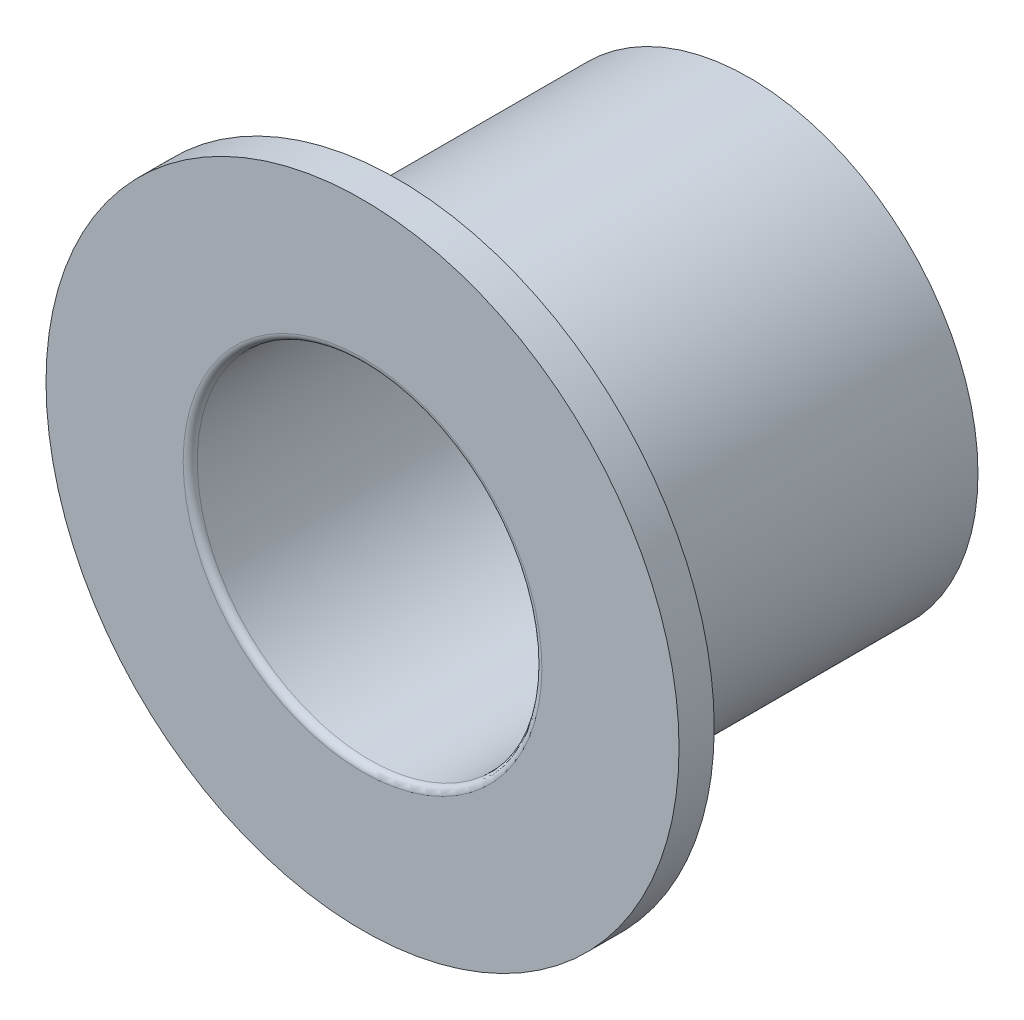
ISO-10303-21;
HEADER;
FILE_DESCRIPTION(('STEP AP214'),'2;1');
FILE_NAME('part.step','',(''),(''),'','','');
FILE_SCHEMA(('AUTOMOTIVE_DESIGN { 1 0 10303 214 1 1 1 1 }'));
ENDSEC;
DATA;
#1=APPLICATION_CONTEXT('core data for automotive mechanical design processes');
#2=APPLICATION_PROTOCOL_DEFINITION('international standard','automotive_design',2000,#1);
#3=PRODUCT_CONTEXT('',#1,'mechanical');
#4=PRODUCT('Part','Part','',(#3));
#5=PRODUCT_RELATED_PRODUCT_CATEGORY('part','',(#4));
#6=PRODUCT_DEFINITION_FORMATION('','',#4);
#7=PRODUCT_DEFINITION_CONTEXT('part definition',#1,'design');
#8=PRODUCT_DEFINITION('design','',#6,#7);
#9=PRODUCT_DEFINITION_SHAPE('','',#8);
#10=(LENGTH_UNIT() NAMED_UNIT(*) SI_UNIT(.MILLI.,.METRE.));
#11=(NAMED_UNIT(*) PLANE_ANGLE_UNIT() SI_UNIT($,.RADIAN.));
#12=(NAMED_UNIT(*) SI_UNIT($,.STERADIAN.) SOLID_ANGLE_UNIT());
#13=UNCERTAINTY_MEASURE_WITH_UNIT(LENGTH_MEASURE(1.E-05),#10,'distance_accuracy_value','');
#14=(GEOMETRIC_REPRESENTATION_CONTEXT(3) GLOBAL_UNCERTAINTY_ASSIGNED_CONTEXT((#13)) GLOBAL_UNIT_ASSIGNED_CONTEXT((#10,
#11,#12)) REPRESENTATION_CONTEXT('',''));
#15=CARTESIAN_POINT('',(0.,0.,0.));
#16=DIRECTION('',(0.,0.,1.));
#17=DIRECTION('',(1.,0.,0.));
#18=AXIS2_PLACEMENT_3D('',#15,#16,#17);
#19=CARTESIAN_POINT('',(0.,0.,2.54));
#20=DIRECTION('',(0.,0.,-1.));
#21=DIRECTION('',(-1.,0.,0.));
#22=AXIS2_PLACEMENT_3D('',#19,#20,#21);
#23=CYLINDRICAL_SURFACE('',#22,1.651);
#24=CARTESIAN_POINT('',(0.,0.,2.54));
#25=DIRECTION('',(0.,0.,1.));
#26=DIRECTION('',(1.,0.,0.));
#27=AXIS2_PLACEMENT_3D('',#24,#25,#26);
#28=CIRCLE('',#27,1.651);
#29=CARTESIAN_POINT('',(1.651,0.,2.54));
#30=VERTEX_POINT('',#29);
#31=EDGE_CURVE('E45',#30,#30,#28,.T.);
#32=ORIENTED_EDGE('',*,*,#31,.F.);
#33=EDGE_LOOP('',(#32));
#34=FACE_BOUND('',#33,.T.);
#35=CARTESIAN_POINT('',(0.,0.,0.));
#36=DIRECTION('',(0.,0.,1.));
#37=DIRECTION('',(1.,0.,0.));
#38=AXIS2_PLACEMENT_3D('',#35,#36,#37);
#39=CIRCLE('',#38,1.651);
#40=CARTESIAN_POINT('',(1.651,0.,0.));
#41=VERTEX_POINT('',#40);
#42=EDGE_CURVE('E49',#41,#41,#39,.T.);
#43=ORIENTED_EDGE('',*,*,#42,.T.);
#44=EDGE_LOOP('',(#43));
#45=FACE_BOUND('',#44,.T.);
#46=ADVANCED_FACE('F34',(#34,#45),#23,.T.);
#47=CARTESIAN_POINT('',(0.,0.,0.));
#48=DIRECTION('',(0.,0.,1.));
#49=DIRECTION('',(1.,0.,0.));
#50=AXIS2_PLACEMENT_3D('',#47,#48,#49);
#51=PLANE('',#50);
#52=CARTESIAN_POINT('',(0.,0.,0.));
#53=DIRECTION('',(0.,0.,1.));
#54=DIRECTION('',(1.,0.,0.));
#55=AXIS2_PLACEMENT_3D('',#52,#53,#54);
#56=CIRCLE('',#55,1.2446);
#57=CARTESIAN_POINT('',(1.2446,0.,0.));
#58=VERTEX_POINT('',#57);
#59=EDGE_CURVE('E58',#58,#58,#56,.T.);
#60=ORIENTED_EDGE('',*,*,#59,.T.);
#61=EDGE_LOOP('',(#60));
#62=FACE_BOUND('',#61,.T.);
#63=ORIENTED_EDGE('',*,*,#42,.F.);
#64=EDGE_LOOP('',(#63));
#65=FACE_BOUND('',#64,.T.);
#66=ADVANCED_FACE('F64',(#62,#65),#51,.F.);
#67=CARTESIAN_POINT('',(0.,0.,2.794));
#68=DIRECTION('',(0.,0.,-1.));
#69=DIRECTION('',(-1.,0.,0.));
#70=AXIS2_PLACEMENT_3D('',#67,#68,#69);
#71=CYLINDRICAL_SURFACE('',#70,2.286);
#72=CARTESIAN_POINT('',(0.,0.,2.794));
#73=DIRECTION('',(0.,0.,1.));
#74=DIRECTION('',(1.,0.,0.));
#75=AXIS2_PLACEMENT_3D('',#72,#73,#74);
#76=CIRCLE('',#75,2.286);
#77=CARTESIAN_POINT('',(2.286,0.,2.794));
#78=VERTEX_POINT('',#77);
#79=EDGE_CURVE('E53',#78,#78,#76,.T.);
#80=ORIENTED_EDGE('',*,*,#79,.F.);
#81=EDGE_LOOP('',(#80));
#82=FACE_BOUND('',#81,.T.);
#83=CARTESIAN_POINT('',(0.,0.,2.54));
#84=DIRECTION('',(0.,0.,1.));
#85=DIRECTION('',(1.,0.,0.));
#86=AXIS2_PLACEMENT_3D('',#83,#84,#85);
#87=CIRCLE('',#86,2.286);
#88=CARTESIAN_POINT('',(2.286,0.,2.54));
#89=VERTEX_POINT('',#88);
#90=EDGE_CURVE('E55',#89,#89,#87,.T.);
#91=ORIENTED_EDGE('',*,*,#90,.T.);
#92=EDGE_LOOP('',(#91));
#93=FACE_BOUND('',#92,.T.);
#94=ADVANCED_FACE('F85',(#82,#93),#71,.T.);
#95=CARTESIAN_POINT('',(0.,0.,2.794));
#96=DIRECTION('',(0.,0.,1.));
#97=DIRECTION('',(1.,0.,0.));
#98=AXIS2_PLACEMENT_3D('',#95,#96,#97);
#99=PLANE('',#98);
#100=CARTESIAN_POINT('',(0.,0.,2.794));
#101=DIRECTION('',(0.,0.,1.));
#102=DIRECTION('',(1.,0.,0.));
#103=AXIS2_PLACEMENT_3D('',#100,#101,#102);
#104=CIRCLE('',#103,1.2954);
#105=CARTESIAN_POINT('',(1.2954,0.,2.794));
#106=VERTEX_POINT('',#105);
#107=EDGE_CURVE('E41',#106,#106,#104,.F.);
#108=ORIENTED_EDGE('',*,*,#107,.T.);
#109=EDGE_LOOP('',(#108));
#110=FACE_BOUND('',#109,.T.);
#111=ORIENTED_EDGE('',*,*,#79,.T.);
#112=EDGE_LOOP('',(#111));
#113=FACE_BOUND('',#112,.T.);
#114=ADVANCED_FACE('F76',(#110,#113),#99,.T.);
#115=CARTESIAN_POINT('',(0.,0.,2.54));
#116=DIRECTION('',(0.,0.,1.));
#117=DIRECTION('',(1.,0.,0.));
#118=AXIS2_PLACEMENT_3D('',#115,#116,#117);
#119=PLANE('',#118);
#120=ORIENTED_EDGE('',*,*,#31,.T.);
#121=EDGE_LOOP('',(#120));
#122=FACE_BOUND('',#121,.T.);
#123=ORIENTED_EDGE('',*,*,#90,.F.);
#124=EDGE_LOOP('',(#123));
#125=FACE_BOUND('',#124,.T.);
#126=ADVANCED_FACE('F69',(#122,#125),#119,.F.);
#127=CARTESIAN_POINT('',(0.,0.,2.794));
#128=DIRECTION('',(0.,0.,-1.));
#129=DIRECTION('',(-1.,0.,0.));
#130=AXIS2_PLACEMENT_3D('',#127,#128,#129);
#131=CYLINDRICAL_SURFACE('',#130,1.2446);
#132=CARTESIAN_POINT('',(0.,0.,2.7432));
#133=DIRECTION('',(0.,0.,1.));
#134=DIRECTION('',(1.,0.,0.));
#135=AXIS2_PLACEMENT_3D('',#132,#133,#134);
#136=CIRCLE('',#135,1.2446);
#137=CARTESIAN_POINT('',(1.2446,0.,2.7432));
#138=VERTEX_POINT('',#137);
#139=EDGE_CURVE('E10',#138,#138,#136,.T.);
#140=ORIENTED_EDGE('',*,*,#139,.T.);
#141=EDGE_LOOP('',(#140));
#142=FACE_BOUND('',#141,.T.);
#143=ORIENTED_EDGE('',*,*,#59,.F.);
#144=EDGE_LOOP('',(#143));
#145=FACE_BOUND('',#144,.T.);
#146=ADVANCED_FACE('F67',(#142,#145),#131,.F.);
#147=CARTESIAN_POINT('',(0.,0.,2.7432));
#148=DIRECTION('',(0.,0.,1.));
#149=DIRECTION('',(1.,0.,0.));
#150=AXIS2_PLACEMENT_3D('',#147,#148,#149);
#151=TOROIDAL_SURFACE('',#150,1.2954,0.0508);
#152=ORIENTED_EDGE('',*,*,#139,.F.);
#153=EDGE_LOOP('',(#152));
#154=FACE_BOUND('',#153,.T.);
#155=ORIENTED_EDGE('',*,*,#107,.F.);
#156=EDGE_LOOP('',(#155));
#157=FACE_BOUND('',#156,.T.);
#158=ADVANCED_FACE('F36',(#154,#157),#151,.T.);
#159=CLOSED_SHELL('',(#46,#66,#94,#114,#126,#146,#158));
#160=MANIFOLD_SOLID_BREP('B2',#159);
#161=ADVANCED_BREP_SHAPE_REPRESENTATION('',(#18,#160),#14);
#162=SHAPE_DEFINITION_REPRESENTATION(#9,#161);
ENDSEC;
END-ISO-10303-21;
